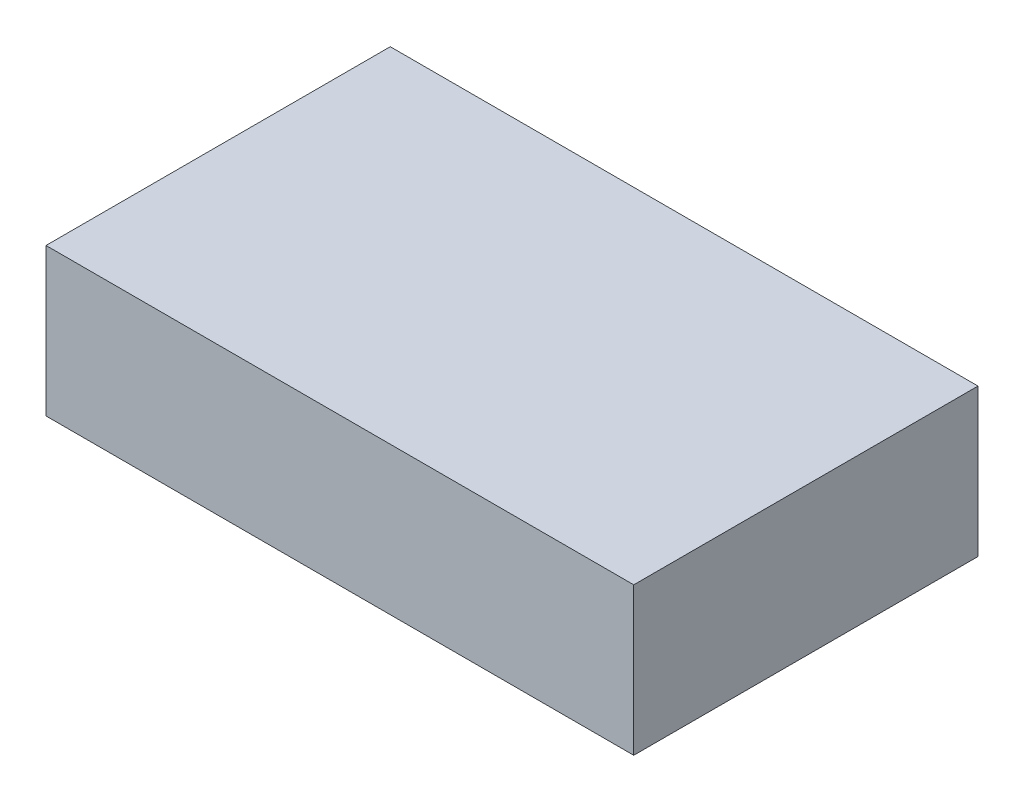
ISO-10303-21;
HEADER;
FILE_DESCRIPTION(('STEP AP214'),'2;1');
FILE_NAME('part.step','',(''),(''),'','','');
FILE_SCHEMA(('AUTOMOTIVE_DESIGN { 1 0 10303 214 1 1 1 1 }'));
ENDSEC;
DATA;
#1=APPLICATION_CONTEXT('core data for automotive mechanical design processes');
#2=APPLICATION_PROTOCOL_DEFINITION('international standard','automotive_design',2000,#1);
#3=PRODUCT_CONTEXT('',#1,'mechanical');
#4=PRODUCT('Part','Part','',(#3));
#5=PRODUCT_RELATED_PRODUCT_CATEGORY('part','',(#4));
#6=PRODUCT_DEFINITION_FORMATION('','',#4);
#7=PRODUCT_DEFINITION_CONTEXT('part definition',#1,'design');
#8=PRODUCT_DEFINITION('design','',#6,#7);
#9=PRODUCT_DEFINITION_SHAPE('','',#8);
#10=(LENGTH_UNIT() NAMED_UNIT(*) SI_UNIT(.MILLI.,.METRE.));
#11=(NAMED_UNIT(*) PLANE_ANGLE_UNIT() SI_UNIT($,.RADIAN.));
#12=(NAMED_UNIT(*) SI_UNIT($,.STERADIAN.) SOLID_ANGLE_UNIT());
#13=UNCERTAINTY_MEASURE_WITH_UNIT(LENGTH_MEASURE(1.E-05),#10,'distance_accuracy_value','');
#14=(GEOMETRIC_REPRESENTATION_CONTEXT(3) GLOBAL_UNCERTAINTY_ASSIGNED_CONTEXT((#13)) GLOBAL_UNIT_ASSIGNED_CONTEXT((#10,
#11,#12)) REPRESENTATION_CONTEXT('',''));
#15=CARTESIAN_POINT('',(0.,0.,0.));
#16=DIRECTION('',(0.,0.,1.));
#17=DIRECTION('',(1.,0.,0.));
#18=AXIS2_PLACEMENT_3D('',#15,#16,#17);
#19=CARTESIAN_POINT('',(10.15000002,-2.54999998,0.));
#20=DIRECTION('',(0.,-1.,0.));
#21=DIRECTION('',(0.,0.,-1.));
#22=AXIS2_PLACEMENT_3D('',#19,#20,#21);
#23=PLANE('',#22);
#24=DIRECTION('',(0.,0.,1.));
#25=VECTOR('',#24,1.);
#26=CARTESIAN_POINT('',(-10.15000002,-2.54999998,0.));
#27=LINE('',#26,#25);
#28=CARTESIAN_POINT('',(-10.15000002,-2.54999998,0.));
#29=VERTEX_POINT('',#28);
#30=CARTESIAN_POINT('',(-10.15000002,-2.54999998,11.88999908));
#31=VERTEX_POINT('',#30);
#32=EDGE_CURVE('E20',#29,#31,#27,.T.);
#33=ORIENTED_EDGE('',*,*,#32,.F.);
#34=DIRECTION('',(1.,0.,0.));
#35=VECTOR('',#34,1.);
#36=CARTESIAN_POINT('',(-10.15000002,-2.54999998,0.));
#37=LINE('',#36,#35);
#38=CARTESIAN_POINT('',(10.15000002,-2.54999998,0.));
#39=VERTEX_POINT('',#38);
#40=EDGE_CURVE('E79',#29,#39,#37,.T.);
#41=ORIENTED_EDGE('',*,*,#40,.T.);
#42=DIRECTION('',(0.,0.,-1.));
#43=VECTOR('',#42,1.);
#44=CARTESIAN_POINT('',(10.15000002,-2.54999998,0.));
#45=LINE('',#44,#43);
#46=CARTESIAN_POINT('',(10.15000002,-2.54999998,11.88999908));
#47=VERTEX_POINT('',#46);
#48=EDGE_CURVE('E61',#47,#39,#45,.T.);
#49=ORIENTED_EDGE('',*,*,#48,.F.);
#50=DIRECTION('',(1.,0.,0.));
#51=VECTOR('',#50,1.);
#52=CARTESIAN_POINT('',(-10.15000002,-2.54999998,11.88999908));
#53=LINE('',#52,#51);
#54=EDGE_CURVE('E56',#31,#47,#53,.T.);
#55=ORIENTED_EDGE('',*,*,#54,.F.);
#56=EDGE_LOOP('',(#33,#41,#49,#55));
#57=FACE_BOUND('',#56,.T.);
#58=ADVANCED_FACE('F17',(#57),#23,.T.);
#59=CARTESIAN_POINT('',(-10.15000002,-2.54999998,0.));
#60=DIRECTION('',(-1.,0.,0.));
#61=DIRECTION('',(0.,0.,1.));
#62=AXIS2_PLACEMENT_3D('',#59,#60,#61);
#63=PLANE('',#62);
#64=DIRECTION('',(0.,0.,1.));
#65=VECTOR('',#64,1.);
#66=CARTESIAN_POINT('',(-10.15000002,2.54999998,0.));
#67=LINE('',#66,#65);
#68=CARTESIAN_POINT('',(-10.15000002,2.54999998,0.));
#69=VERTEX_POINT('',#68);
#70=CARTESIAN_POINT('',(-10.15000002,2.54999998,11.88999908));
#71=VERTEX_POINT('',#70);
#72=EDGE_CURVE('E83',#69,#71,#67,.T.);
#73=ORIENTED_EDGE('',*,*,#72,.F.);
#74=DIRECTION('',(0.,1.,0.));
#75=VECTOR('',#74,1.);
#76=CARTESIAN_POINT('',(-10.15000002,-2.54999998,0.));
#77=LINE('',#76,#75);
#78=EDGE_CURVE('E68',#69,#29,#77,.F.);
#79=ORIENTED_EDGE('',*,*,#78,.T.);
#80=ORIENTED_EDGE('',*,*,#32,.T.);
#81=DIRECTION('',(0.,1.,0.));
#82=VECTOR('',#81,1.);
#83=CARTESIAN_POINT('',(-10.15000002,-2.54999998,11.88999908));
#84=LINE('',#83,#82);
#85=EDGE_CURVE('E63',#71,#31,#84,.F.);
#86=ORIENTED_EDGE('',*,*,#85,.F.);
#87=EDGE_LOOP('',(#73,#79,#80,#86));
#88=FACE_BOUND('',#87,.T.);
#89=ADVANCED_FACE('F65',(#88),#63,.T.);
#90=CARTESIAN_POINT('',(-10.15000002,-2.54999998,11.88999908));
#91=DIRECTION('',(0.,0.,1.));
#92=DIRECTION('',(1.,0.,0.));
#93=AXIS2_PLACEMENT_3D('',#90,#91,#92);
#94=PLANE('',#93);
#95=DIRECTION('',(1.,0.,0.));
#96=VECTOR('',#95,1.);
#97=CARTESIAN_POINT('',(-10.15000002,2.54999998,11.88999908));
#98=LINE('',#97,#96);
#99=CARTESIAN_POINT('',(10.15000002,2.54999998,11.88999908));
#100=VERTEX_POINT('',#99);
#101=EDGE_CURVE('E72',#71,#100,#98,.T.);
#102=ORIENTED_EDGE('',*,*,#101,.F.);
#103=ORIENTED_EDGE('',*,*,#85,.T.);
#104=ORIENTED_EDGE('',*,*,#54,.T.);
#105=DIRECTION('',(0.,1.,0.));
#106=VECTOR('',#105,1.);
#107=CARTESIAN_POINT('',(10.15000002,2.54999998,11.88999908));
#108=LINE('',#107,#106);
#109=EDGE_CURVE('E74',#100,#47,#108,.F.);
#110=ORIENTED_EDGE('',*,*,#109,.F.);
#111=EDGE_LOOP('',(#102,#103,#104,#110));
#112=FACE_BOUND('',#111,.T.);
#113=ADVANCED_FACE('F70',(#112),#94,.T.);
#114=CARTESIAN_POINT('',(10.15000002,2.54999998,0.));
#115=DIRECTION('',(1.,0.,0.));
#116=DIRECTION('',(0.,0.,-1.));
#117=AXIS2_PLACEMENT_3D('',#114,#115,#116);
#118=PLANE('',#117);
#119=ORIENTED_EDGE('',*,*,#48,.T.);
#120=DIRECTION('',(0.,1.,0.));
#121=VECTOR('',#120,1.);
#122=CARTESIAN_POINT('',(10.15000002,-2.54999998,0.));
#123=LINE('',#122,#121);
#124=CARTESIAN_POINT('',(10.15000002,2.54999998,0.));
#125=VERTEX_POINT('',#124);
#126=EDGE_CURVE('E35',#39,#125,#123,.T.);
#127=ORIENTED_EDGE('',*,*,#126,.T.);
#128=DIRECTION('',(0.,0.,1.));
#129=VECTOR('',#128,1.);
#130=CARTESIAN_POINT('',(10.15000002,2.54999998,0.));
#131=LINE('',#130,#129);
#132=EDGE_CURVE('E26',#100,#125,#131,.F.);
#133=ORIENTED_EDGE('',*,*,#132,.F.);
#134=ORIENTED_EDGE('',*,*,#109,.T.);
#135=EDGE_LOOP('',(#119,#127,#133,#134));
#136=FACE_BOUND('',#135,.T.);
#137=ADVANCED_FACE('F89',(#136),#118,.T.);
#138=CARTESIAN_POINT('',(-10.15000002,-2.54999998,0.));
#139=DIRECTION('',(0.,0.,1.));
#140=DIRECTION('',(1.,0.,0.));
#141=AXIS2_PLACEMENT_3D('',#138,#139,#140);
#142=PLANE('',#141);
#143=DIRECTION('',(1.,0.,0.));
#144=VECTOR('',#143,1.);
#145=CARTESIAN_POINT('',(-10.15000002,2.54999998,0.));
#146=LINE('',#145,#144);
#147=EDGE_CURVE('E11',#125,#69,#146,.F.);
#148=ORIENTED_EDGE('',*,*,#147,.F.);
#149=ORIENTED_EDGE('',*,*,#126,.F.);
#150=ORIENTED_EDGE('',*,*,#40,.F.);
#151=ORIENTED_EDGE('',*,*,#78,.F.);
#152=EDGE_LOOP('',(#148,#149,#150,#151));
#153=FACE_BOUND('',#152,.T.);
#154=ADVANCED_FACE('F91',(#153),#142,.F.);
#155=CARTESIAN_POINT('',(-10.15000002,2.54999998,0.));
#156=DIRECTION('',(0.,1.,0.));
#157=DIRECTION('',(0.,0.,1.));
#158=AXIS2_PLACEMENT_3D('',#155,#156,#157);
#159=PLANE('',#158);
#160=ORIENTED_EDGE('',*,*,#132,.T.);
#161=ORIENTED_EDGE('',*,*,#147,.T.);
#162=ORIENTED_EDGE('',*,*,#72,.T.);
#163=ORIENTED_EDGE('',*,*,#101,.T.);
#164=EDGE_LOOP('',(#160,#161,#162,#163));
#165=FACE_BOUND('',#164,.T.);
#166=ADVANCED_FACE('F88',(#165),#159,.T.);
#167=CLOSED_SHELL('',(#58,#89,#113,#137,#154,#166));
#168=MANIFOLD_SOLID_BREP('B1',#167);
#169=ADVANCED_BREP_SHAPE_REPRESENTATION('',(#18,#168),#14);
#170=SHAPE_DEFINITION_REPRESENTATION(#9,#169);
ENDSEC;
END-ISO-10303-21;
